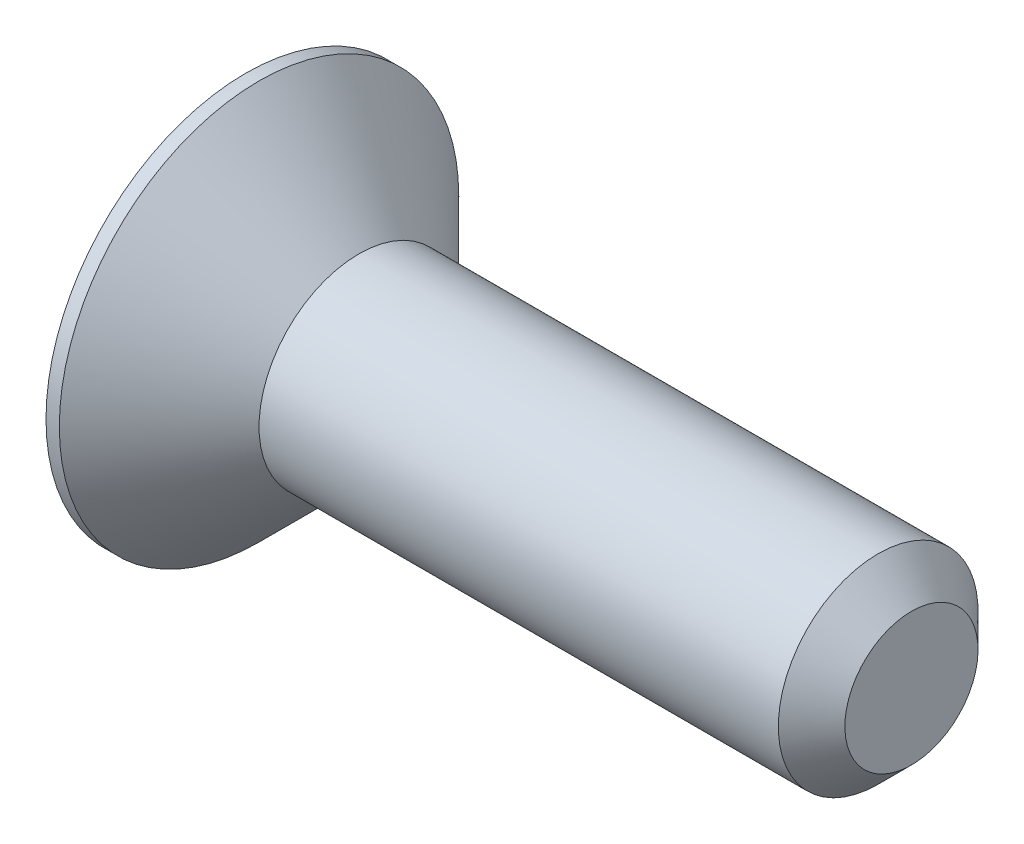
ISO-10303-21;
HEADER;
FILE_DESCRIPTION(('STEP AP214'),'2;1');
FILE_NAME('part.step','',(''),(''),'','','');
FILE_SCHEMA(('AUTOMOTIVE_DESIGN { 1 0 10303 214 1 1 1 1 }'));
ENDSEC;
DATA;
#1=APPLICATION_CONTEXT('core data for automotive mechanical design processes');
#2=APPLICATION_PROTOCOL_DEFINITION('international standard','automotive_design',2000,#1);
#3=PRODUCT_CONTEXT('',#1,'mechanical');
#4=PRODUCT('Part','Part','',(#3));
#5=PRODUCT_RELATED_PRODUCT_CATEGORY('part','',(#4));
#6=PRODUCT_DEFINITION_FORMATION('','',#4);
#7=PRODUCT_DEFINITION_CONTEXT('part definition',#1,'design');
#8=PRODUCT_DEFINITION('design','',#6,#7);
#9=PRODUCT_DEFINITION_SHAPE('','',#8);
#10=(LENGTH_UNIT() NAMED_UNIT(*) SI_UNIT(.MILLI.,.METRE.));
#11=(NAMED_UNIT(*) PLANE_ANGLE_UNIT() SI_UNIT($,.RADIAN.));
#12=(NAMED_UNIT(*) SI_UNIT($,.STERADIAN.) SOLID_ANGLE_UNIT());
#13=UNCERTAINTY_MEASURE_WITH_UNIT(LENGTH_MEASURE(1.E-05),#10,'distance_accuracy_value','');
#14=(GEOMETRIC_REPRESENTATION_CONTEXT(3) GLOBAL_UNCERTAINTY_ASSIGNED_CONTEXT((#13)) GLOBAL_UNIT_ASSIGNED_CONTEXT((#10,
#11,#12)) REPRESENTATION_CONTEXT('',''));
#15=CARTESIAN_POINT('',(0.,0.,0.));
#16=DIRECTION('',(0.,0.,1.));
#17=DIRECTION('',(1.,0.,0.));
#18=AXIS2_PLACEMENT_3D('',#15,#16,#17);
#19=CARTESIAN_POINT('',(0.,0.,0.));
#20=DIRECTION('',(-1.,0.,0.));
#21=DIRECTION('',(0.,-1.,0.));
#22=AXIS2_PLACEMENT_3D('',#19,#20,#21);
#23=PLANE('',#22);
#24=DIRECTION('',(0.,0.5,-0.866025403784438));
#25=VECTOR('',#24,1.);
#26=CARTESIAN_POINT('',(0.,0.577350269189626,1.));
#27=LINE('',#26,#25);
#28=CARTESIAN_POINT('',(0.,0.577350269189626,1.));
#29=VERTEX_POINT('',#28);
#30=CARTESIAN_POINT('',(0.,1.15470053837925,0.));
#31=VERTEX_POINT('',#30);
#32=EDGE_CURVE('E48',#29,#31,#27,.T.);
#33=ORIENTED_EDGE('',*,*,#32,.F.);
#34=DIRECTION('',(0.,1.,0.));
#35=VECTOR('',#34,1.);
#36=CARTESIAN_POINT('',(0.,-0.577350269189626,1.));
#37=LINE('',#36,#35);
#38=CARTESIAN_POINT('',(0.,-0.577350269189626,1.));
#39=VERTEX_POINT('',#38);
#40=EDGE_CURVE('E131',#39,#29,#37,.T.);
#41=ORIENTED_EDGE('',*,*,#40,.F.);
#42=DIRECTION('',(0.,0.5,0.866025403784439));
#43=VECTOR('',#42,1.);
#44=CARTESIAN_POINT('',(0.,-1.15470053837925,0.));
#45=LINE('',#44,#43);
#46=CARTESIAN_POINT('',(0.,-1.15470053837925,0.));
#47=VERTEX_POINT('',#46);
#48=EDGE_CURVE('E129',#47,#39,#45,.T.);
#49=ORIENTED_EDGE('',*,*,#48,.F.);
#50=DIRECTION('',(0.,-0.5,0.866025403784439));
#51=VECTOR('',#50,1.);
#52=CARTESIAN_POINT('',(0.,-0.577350269189625,-1.));
#53=LINE('',#52,#51);
#54=CARTESIAN_POINT('',(0.,-0.577350269189625,-1.));
#55=VERTEX_POINT('',#54);
#56=EDGE_CURVE('E96',#55,#47,#53,.T.);
#57=ORIENTED_EDGE('',*,*,#56,.F.);
#58=DIRECTION('',(0.,-1.,0.));
#59=VECTOR('',#58,1.);
#60=CARTESIAN_POINT('',(0.,0.577350269189626,-1.));
#61=LINE('',#60,#59);
#62=CARTESIAN_POINT('',(0.,0.577350269189626,-1.));
#63=VERTEX_POINT('',#62);
#64=EDGE_CURVE('E125',#63,#55,#61,.T.);
#65=ORIENTED_EDGE('',*,*,#64,.F.);
#66=DIRECTION('',(0.,-0.5,-0.866025403784439));
#67=VECTOR('',#66,1.);
#68=CARTESIAN_POINT('',(0.,1.15470053837925,0.));
#69=LINE('',#68,#67);
#70=EDGE_CURVE('E122',#31,#63,#69,.T.);
#71=ORIENTED_EDGE('',*,*,#70,.F.);
#72=EDGE_LOOP('',(#33,#41,#49,#57,#65,#71));
#73=FACE_BOUND('',#72,.T.);
#74=CARTESIAN_POINT('',(0.,0.,0.));
#75=DIRECTION('',(1.,0.,0.));
#76=DIRECTION('',(0.,1.,0.));
#77=AXIS2_PLACEMENT_3D('',#74,#75,#76);
#78=CIRCLE('',#77,3.);
#79=CARTESIAN_POINT('',(0.,3.,0.));
#80=VERTEX_POINT('',#79);
#81=EDGE_CURVE('E146',#80,#80,#78,.T.);
#82=ORIENTED_EDGE('',*,*,#81,.F.);
#83=EDGE_LOOP('',(#82));
#84=FACE_BOUND('',#83,.T.);
#85=ADVANCED_FACE('F33',(#73,#84),#23,.T.);
#86=CARTESIAN_POINT('',(10.,0.,0.));
#87=DIRECTION('',(1.,0.,0.));
#88=DIRECTION('',(0.,1.,0.));
#89=AXIS2_PLACEMENT_3D('',#86,#87,#88);
#90=CYLINDRICAL_SURFACE('',#89,3.);
#91=ORIENTED_EDGE('',*,*,#81,.T.);
#92=EDGE_LOOP('',(#91));
#93=FACE_BOUND('',#92,.T.);
#94=CARTESIAN_POINT('',(0.199999999999962,0.,0.));
#95=DIRECTION('',(1.,0.,0.));
#96=DIRECTION('',(0.,1.,0.));
#97=AXIS2_PLACEMENT_3D('',#94,#95,#96);
#98=CIRCLE('',#97,3.);
#99=CARTESIAN_POINT('',(0.199999999999963,3.,0.));
#100=VERTEX_POINT('',#99);
#101=EDGE_CURVE('E143',#100,#100,#98,.T.);
#102=ORIENTED_EDGE('',*,*,#101,.F.);
#103=EDGE_LOOP('',(#102));
#104=FACE_BOUND('',#103,.T.);
#105=ADVANCED_FACE('F166',(#93,#104),#90,.T.);
#106=CARTESIAN_POINT('',(1.7,0.,0.));
#107=DIRECTION('',(-1.,0.,0.));
#108=DIRECTION('',(0.,-1.,0.));
#109=AXIS2_PLACEMENT_3D('',#106,#107,#108);
#110=CONICAL_SURFACE('',#109,1.5,0.785398163397436);
#111=ORIENTED_EDGE('',*,*,#101,.T.);
#112=EDGE_LOOP('',(#111));
#113=FACE_BOUND('',#112,.T.);
#114=CARTESIAN_POINT('',(1.7,0.,0.));
#115=DIRECTION('',(1.,0.,0.));
#116=DIRECTION('',(0.,1.,0.));
#117=AXIS2_PLACEMENT_3D('',#114,#115,#116);
#118=CIRCLE('',#117,1.5);
#119=CARTESIAN_POINT('',(1.7,1.5,0.));
#120=VERTEX_POINT('',#119);
#121=EDGE_CURVE('E135',#120,#120,#118,.T.);
#122=ORIENTED_EDGE('',*,*,#121,.F.);
#123=EDGE_LOOP('',(#122));
#124=FACE_BOUND('',#123,.T.);
#125=ADVANCED_FACE('F171',(#113,#124),#110,.T.);
#126=CARTESIAN_POINT('',(10.,0.,0.));
#127=DIRECTION('',(1.,0.,0.));
#128=DIRECTION('',(0.,1.,0.));
#129=AXIS2_PLACEMENT_3D('',#126,#127,#128);
#130=CYLINDRICAL_SURFACE('',#129,1.5);
#131=CARTESIAN_POINT('',(9.5,0.,0.));
#132=DIRECTION('',(1.,0.,0.));
#133=DIRECTION('',(0.,1.,0.));
#134=AXIS2_PLACEMENT_3D('',#131,#132,#133);
#135=CIRCLE('',#134,1.5);
#136=CARTESIAN_POINT('',(9.5,1.5,0.));
#137=VERTEX_POINT('',#136);
#138=EDGE_CURVE('E11',#137,#137,#135,.F.);
#139=ORIENTED_EDGE('',*,*,#138,.T.);
#140=EDGE_LOOP('',(#139));
#141=FACE_BOUND('',#140,.T.);
#142=ORIENTED_EDGE('',*,*,#121,.T.);
#143=EDGE_LOOP('',(#142));
#144=FACE_BOUND('',#143,.T.);
#145=ADVANCED_FACE('F162',(#141,#144),#130,.T.);
#146=CARTESIAN_POINT('',(10.,1.5,0.));
#147=DIRECTION('',(1.,0.,0.));
#148=DIRECTION('',(0.,1.,0.));
#149=AXIS2_PLACEMENT_3D('',#146,#147,#148);
#150=PLANE('',#149);
#151=CARTESIAN_POINT('',(10.,0.,0.));
#152=DIRECTION('',(1.,0.,0.));
#153=DIRECTION('',(0.,1.,0.));
#154=AXIS2_PLACEMENT_3D('',#151,#152,#153);
#155=CIRCLE('',#154,0.999999999999998);
#156=CARTESIAN_POINT('',(10.,0.999999999999995,0.));
#157=VERTEX_POINT('',#156);
#158=EDGE_CURVE('E41',#157,#157,#155,.T.);
#159=ORIENTED_EDGE('',*,*,#158,.T.);
#160=EDGE_LOOP('',(#159));
#161=FACE_BOUND('',#160,.T.);
#162=ADVANCED_FACE('F151',(#161),#150,.T.);
#163=CARTESIAN_POINT('',(10.,0.,0.));
#164=DIRECTION('',(-1.,0.,0.));
#165=DIRECTION('',(0.,-1.,0.));
#166=AXIS2_PLACEMENT_3D('',#163,#164,#165);
#167=CONICAL_SURFACE('',#166,0.999999999999998,0.785398163397447);
#168=ORIENTED_EDGE('',*,*,#138,.F.);
#169=EDGE_LOOP('',(#168));
#170=FACE_BOUND('',#169,.T.);
#171=ORIENTED_EDGE('',*,*,#158,.F.);
#172=EDGE_LOOP('',(#171));
#173=FACE_BOUND('',#172,.T.);
#174=ADVANCED_FACE('F35',(#170,#173),#167,.T.);
#175=CARTESIAN_POINT('',(1.2,0.577350269189626,1.));
#176=DIRECTION('',(0.,0.866025403784439,0.5));
#177=DIRECTION('',(0.,-0.5,0.866025403784439));
#178=AXIS2_PLACEMENT_3D('',#175,#176,#177);
#179=PLANE('',#178);
#180=ORIENTED_EDGE('',*,*,#32,.T.);
#181=DIRECTION('',(-1.,0.,0.));
#182=VECTOR('',#181,1.);
#183=CARTESIAN_POINT('',(1.2,1.15470053837925,0.));
#184=LINE('',#183,#182);
#185=CARTESIAN_POINT('',(1.2,1.15470053837925,0.));
#186=VERTEX_POINT('',#185);
#187=EDGE_CURVE('E78',#186,#31,#184,.T.);
#188=ORIENTED_EDGE('',*,*,#187,.F.);
#189=DIRECTION('',(0.,0.5,-0.866025403784438));
#190=VECTOR('',#189,1.);
#191=CARTESIAN_POINT('',(1.2,0.577350269189626,1.));
#192=LINE('',#191,#190);
#193=CARTESIAN_POINT('',(1.2,0.577350269189626,1.));
#194=VERTEX_POINT('',#193);
#195=EDGE_CURVE('E133',#194,#186,#192,.T.);
#196=ORIENTED_EDGE('',*,*,#195,.F.);
#197=DIRECTION('',(-1.,0.,0.));
#198=VECTOR('',#197,1.);
#199=CARTESIAN_POINT('',(1.2,0.577350269189626,1.));
#200=LINE('',#199,#198);
#201=EDGE_CURVE('E56',#194,#29,#200,.T.);
#202=ORIENTED_EDGE('',*,*,#201,.T.);
#203=EDGE_LOOP('',(#180,#188,#196,#202));
#204=FACE_BOUND('',#203,.T.);
#205=ADVANCED_FACE('F154',(#204),#179,.F.);
#206=CARTESIAN_POINT('',(1.2,-0.577350269189627,1.));
#207=DIRECTION('',(0.,0.,1.));
#208=DIRECTION('',(0.,-1.,0.));
#209=AXIS2_PLACEMENT_3D('',#206,#207,#208);
#210=PLANE('',#209);
#211=ORIENTED_EDGE('',*,*,#40,.T.);
#212=ORIENTED_EDGE('',*,*,#201,.F.);
#213=DIRECTION('',(0.,1.,0.));
#214=VECTOR('',#213,1.);
#215=CARTESIAN_POINT('',(1.2,-0.577350269189627,1.));
#216=LINE('',#215,#214);
#217=CARTESIAN_POINT('',(1.2,-0.577350269189627,1.));
#218=VERTEX_POINT('',#217);
#219=EDGE_CURVE('E108',#218,#194,#216,.T.);
#220=ORIENTED_EDGE('',*,*,#219,.F.);
#221=DIRECTION('',(-1.,0.,0.));
#222=VECTOR('',#221,1.);
#223=CARTESIAN_POINT('',(1.2,-0.577350269189627,1.));
#224=LINE('',#223,#222);
#225=EDGE_CURVE('E100',#218,#39,#224,.T.);
#226=ORIENTED_EDGE('',*,*,#225,.T.);
#227=EDGE_LOOP('',(#211,#212,#220,#226));
#228=FACE_BOUND('',#227,.T.);
#229=ADVANCED_FACE('F160',(#228),#210,.F.);
#230=CARTESIAN_POINT('',(1.2,-1.15470053837925,0.));
#231=DIRECTION('',(0.,-0.866025403784439,0.5));
#232=DIRECTION('',(0.,-0.5,-0.866025403784439));
#233=AXIS2_PLACEMENT_3D('',#230,#231,#232);
#234=PLANE('',#233);
#235=ORIENTED_EDGE('',*,*,#48,.T.);
#236=ORIENTED_EDGE('',*,*,#225,.F.);
#237=DIRECTION('',(0.,0.5,0.866025403784439));
#238=VECTOR('',#237,1.);
#239=CARTESIAN_POINT('',(1.2,-1.15470053837925,0.));
#240=LINE('',#239,#238);
#241=CARTESIAN_POINT('',(1.2,-1.15470053837925,0.));
#242=VERTEX_POINT('',#241);
#243=EDGE_CURVE('E104',#242,#218,#240,.T.);
#244=ORIENTED_EDGE('',*,*,#243,.F.);
#245=DIRECTION('',(-1.,0.,0.));
#246=VECTOR('',#245,1.);
#247=CARTESIAN_POINT('',(1.2,-1.15470053837925,0.));
#248=LINE('',#247,#246);
#249=EDGE_CURVE('E89',#242,#47,#248,.T.);
#250=ORIENTED_EDGE('',*,*,#249,.T.);
#251=EDGE_LOOP('',(#235,#236,#244,#250));
#252=FACE_BOUND('',#251,.T.);
#253=ADVANCED_FACE('F105',(#252),#234,.F.);
#254=CARTESIAN_POINT('',(1.2,-0.577350269189626,-1.));
#255=DIRECTION('',(0.,-0.866025403784439,-0.5));
#256=DIRECTION('',(0.,0.5,-0.866025403784439));
#257=AXIS2_PLACEMENT_3D('',#254,#255,#256);
#258=PLANE('',#257);
#259=ORIENTED_EDGE('',*,*,#56,.T.);
#260=ORIENTED_EDGE('',*,*,#249,.F.);
#261=DIRECTION('',(0.,-0.5,0.866025403784439));
#262=VECTOR('',#261,1.);
#263=CARTESIAN_POINT('',(1.2,-0.577350269189626,-1.));
#264=LINE('',#263,#262);
#265=CARTESIAN_POINT('',(1.2,-0.577350269189626,-1.));
#266=VERTEX_POINT('',#265);
#267=EDGE_CURVE('E93',#266,#242,#264,.T.);
#268=ORIENTED_EDGE('',*,*,#267,.F.);
#269=DIRECTION('',(-1.,0.,0.));
#270=VECTOR('',#269,1.);
#271=CARTESIAN_POINT('',(1.2,-0.577350269189626,-1.));
#272=LINE('',#271,#270);
#273=EDGE_CURVE('E101',#266,#55,#272,.T.);
#274=ORIENTED_EDGE('',*,*,#273,.T.);
#275=EDGE_LOOP('',(#259,#260,#268,#274));
#276=FACE_BOUND('',#275,.T.);
#277=ADVANCED_FACE('F91',(#276),#258,.F.);
#278=CARTESIAN_POINT('',(1.2,0.577350269189626,-1.));
#279=DIRECTION('',(0.,0.,-1.));
#280=DIRECTION('',(-1.,0.,0.));
#281=AXIS2_PLACEMENT_3D('',#278,#279,#280);
#282=PLANE('',#281);
#283=ORIENTED_EDGE('',*,*,#64,.T.);
#284=ORIENTED_EDGE('',*,*,#273,.F.);
#285=DIRECTION('',(0.,-1.,0.));
#286=VECTOR('',#285,1.);
#287=CARTESIAN_POINT('',(1.2,0.577350269189626,-1.));
#288=LINE('',#287,#286);
#289=CARTESIAN_POINT('',(1.2,0.577350269189626,-1.));
#290=VERTEX_POINT('',#289);
#291=EDGE_CURVE('E114',#290,#266,#288,.T.);
#292=ORIENTED_EDGE('',*,*,#291,.F.);
#293=DIRECTION('',(-1.,0.,0.));
#294=VECTOR('',#293,1.);
#295=CARTESIAN_POINT('',(1.2,0.577350269189626,-1.));
#296=LINE('',#295,#294);
#297=EDGE_CURVE('E138',#290,#63,#296,.T.);
#298=ORIENTED_EDGE('',*,*,#297,.T.);
#299=EDGE_LOOP('',(#283,#284,#292,#298));
#300=FACE_BOUND('',#299,.T.);
#301=ADVANCED_FACE('F185',(#300),#282,.F.);
#302=CARTESIAN_POINT('',(1.2,1.15470053837925,0.));
#303=DIRECTION('',(0.,0.866025403784439,-0.5));
#304=DIRECTION('',(0.,0.5,0.866025403784439));
#305=AXIS2_PLACEMENT_3D('',#302,#303,#304);
#306=PLANE('',#305);
#307=ORIENTED_EDGE('',*,*,#70,.T.);
#308=ORIENTED_EDGE('',*,*,#297,.F.);
#309=DIRECTION('',(0.,-0.5,-0.866025403784439));
#310=VECTOR('',#309,1.);
#311=CARTESIAN_POINT('',(1.2,1.15470053837925,0.));
#312=LINE('',#311,#310);
#313=EDGE_CURVE('E116',#186,#290,#312,.T.);
#314=ORIENTED_EDGE('',*,*,#313,.F.);
#315=ORIENTED_EDGE('',*,*,#187,.T.);
#316=EDGE_LOOP('',(#307,#308,#314,#315));
#317=FACE_BOUND('',#316,.T.);
#318=ADVANCED_FACE('F182',(#317),#306,.F.);
#319=CARTESIAN_POINT('',(1.2,0.,0.));
#320=DIRECTION('',(-1.,0.,0.));
#321=DIRECTION('',(0.,-1.,0.));
#322=AXIS2_PLACEMENT_3D('',#319,#320,#321);
#323=PLANE('',#322);
#324=ORIENTED_EDGE('',*,*,#195,.T.);
#325=ORIENTED_EDGE('',*,*,#313,.T.);
#326=ORIENTED_EDGE('',*,*,#291,.T.);
#327=ORIENTED_EDGE('',*,*,#267,.T.);
#328=ORIENTED_EDGE('',*,*,#243,.T.);
#329=ORIENTED_EDGE('',*,*,#219,.T.);
#330=EDGE_LOOP('',(#324,#325,#326,#327,#328,#329));
#331=FACE_BOUND('',#330,.T.);
#332=ADVANCED_FACE('F111',(#331),#323,.T.);
#333=CLOSED_SHELL('',(#85,#105,#125,#145,#162,#174,#205,#229,#253,#277,#301,#318,#332));
#334=MANIFOLD_SOLID_BREP('B2',#333);
#335=ADVANCED_BREP_SHAPE_REPRESENTATION('',(#18,#334),#14);
#336=SHAPE_DEFINITION_REPRESENTATION(#9,#335);
ENDSEC;
END-ISO-10303-21;
